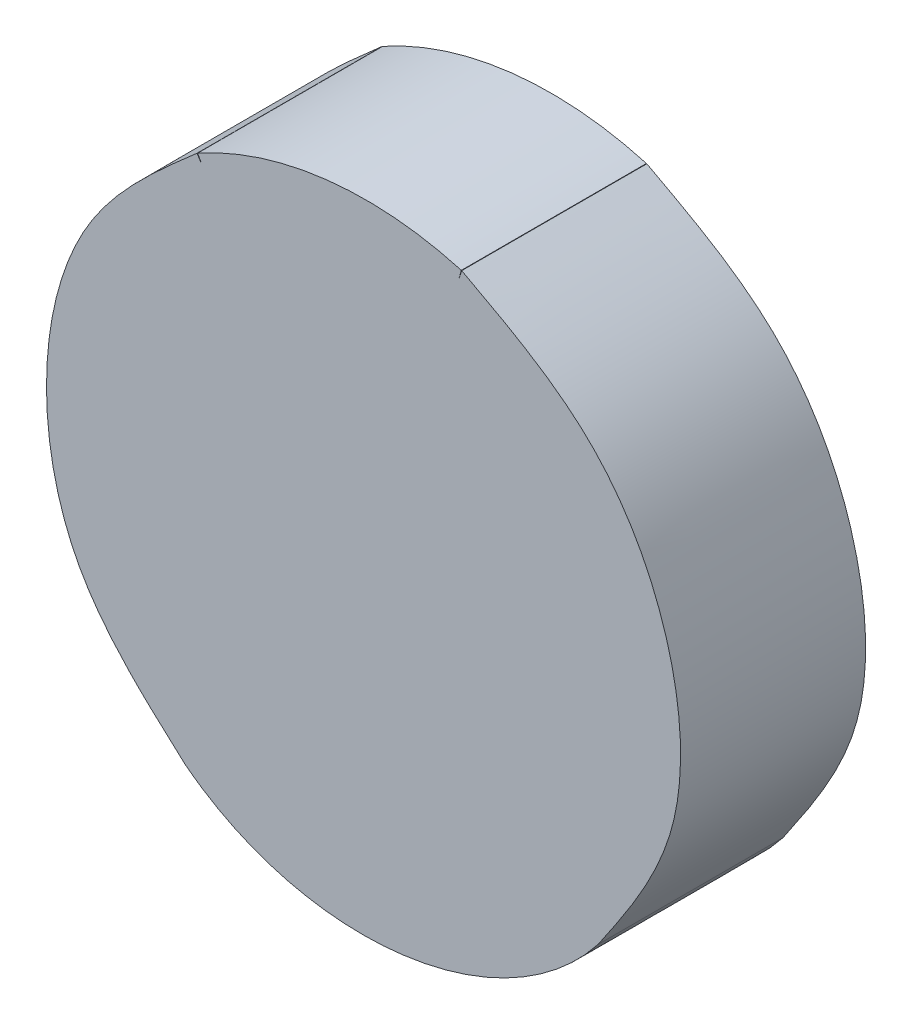
ISO-10303-21;
HEADER;
FILE_DESCRIPTION(('STEP AP214'),'2;1');
FILE_NAME('part.step','',(''),(''),'','','');
FILE_SCHEMA(('AUTOMOTIVE_DESIGN { 1 0 10303 214 1 1 1 1 }'));
ENDSEC;
DATA;
#1=APPLICATION_CONTEXT('core data for automotive mechanical design processes');
#2=APPLICATION_PROTOCOL_DEFINITION('international standard','automotive_design',2000,#1);
#3=PRODUCT_CONTEXT('',#1,'mechanical');
#4=PRODUCT('Part','Part','',(#3));
#5=PRODUCT_RELATED_PRODUCT_CATEGORY('part','',(#4));
#6=PRODUCT_DEFINITION_FORMATION('','',#4);
#7=PRODUCT_DEFINITION_CONTEXT('part definition',#1,'design');
#8=PRODUCT_DEFINITION('design','',#6,#7);
#9=PRODUCT_DEFINITION_SHAPE('','',#8);
#10=(LENGTH_UNIT() NAMED_UNIT(*) SI_UNIT(.MILLI.,.METRE.));
#11=(NAMED_UNIT(*) PLANE_ANGLE_UNIT() SI_UNIT($,.RADIAN.));
#12=(NAMED_UNIT(*) SI_UNIT($,.STERADIAN.) SOLID_ANGLE_UNIT());
#13=UNCERTAINTY_MEASURE_WITH_UNIT(LENGTH_MEASURE(1.E-05),#10,'distance_accuracy_value','');
#14=(GEOMETRIC_REPRESENTATION_CONTEXT(3) GLOBAL_UNCERTAINTY_ASSIGNED_CONTEXT((#13)) GLOBAL_UNIT_ASSIGNED_CONTEXT((#10,
#11,#12)) REPRESENTATION_CONTEXT('',''));
#15=CARTESIAN_POINT('',(0.,0.,0.));
#16=DIRECTION('',(0.,0.,1.));
#17=DIRECTION('',(1.,0.,0.));
#18=AXIS2_PLACEMENT_3D('',#15,#16,#17);
#19=CARTESIAN_POINT('',(-17.9585100029639,25.4594414816316,-51.0219187273409));
#20=DIRECTION('',(0.8322225883832,0.554441668153438,0.));
#21=DIRECTION('',(-0.554441668153438,0.8322225883832,0.));
#22=AXIS2_PLACEMENT_3D('',#19,#20,#21);
#23=PLANE('',#22);
#24=CARTESIAN_POINT('',(-17.9585100029639,25.4594414816316,-52.3040000000001));
#25=DIRECTION('',(0.554441668153438,-0.8322225883832,0.));
#26=VECTOR('',#25,1.);
#27=LINE('',#24,#26);
#28=CARTESIAN_POINT('',(-17.9585100029639,25.4594414816316,-52.3040000000001));
#29=VERTEX_POINT('',#28);
#30=CARTESIAN_POINT('',(-17.9235256596213,25.406929626117,-52.3040000000001));
#31=VERTEX_POINT('',#30);
#32=EDGE_CURVE('E382',#29,#31,#27,.T.);
#33=ORIENTED_EDGE('',*,*,#32,.F.);
#34=CARTESIAN_POINT('',(-17.9585100029639,25.4594414816316,-51.0219187273409));
#35=DIRECTION('',(0.,0.,-1.));
#36=VECTOR('',#35,1.);
#37=LINE('',#34,#36);
#38=CARTESIAN_POINT('',(-17.9585100029639,25.4594414816316,-51.0219187273409));
#39=VERTEX_POINT('',#38);
#40=EDGE_CURVE('E35',#39,#29,#37,.T.);
#41=ORIENTED_EDGE('',*,*,#40,.F.);
#42=CARTESIAN_POINT('',(-17.9585100029639,25.4594414816316,-51.0219187273409));
#43=DIRECTION('',(0.554441668153438,-0.8322225883832,0.));
#44=VECTOR('',#43,1.);
#45=LINE('',#42,#44);
#46=CARTESIAN_POINT('',(-17.9235256596213,25.406929626117,-51.0219187273409));
#47=VERTEX_POINT('',#46);
#48=EDGE_CURVE('E202',#39,#47,#45,.T.);
#49=ORIENTED_EDGE('',*,*,#48,.T.);
#50=CARTESIAN_POINT('',(-17.9235256596214,25.4069296261169,-51.0219187273409));
#51=DIRECTION('',(0.,0.,-1.));
#52=VECTOR('',#51,1.);
#53=LINE('',#50,#52);
#54=EDGE_CURVE('E10',#47,#31,#53,.T.);
#55=ORIENTED_EDGE('',*,*,#54,.T.);
#56=EDGE_LOOP('',(#33,#41,#49,#55));
#57=FACE_BOUND('',#56,.T.);
#58=ADVANCED_FACE('F16',(#57),#23,.T.);
#59=CARTESIAN_POINT('',(-17.9235256596213,25.4069296261169,-51.021918727341));
#60=DIRECTION('',(-0.873926326381101,-0.486058408072563,0.));
#61=DIRECTION('',(0.486058408072563,-0.873926326381101,0.));
#62=AXIS2_PLACEMENT_3D('',#59,#60,#61);
#63=PLANE('',#62);
#64=DIRECTION('',(-0.486058408072563,0.873926326381101,3.2990859998867E-13));
#65=VECTOR('',#64,1.);
#66=CARTESIAN_POINT('',(-17.9235256596213,25.4069296261169,-52.3040000000001));
#67=LINE('',#66,#65);
#68=CARTESIAN_POINT('',(-17.9541951334528,25.4620729178541,-52.3040000000001));
#69=VERTEX_POINT('',#68);
#70=EDGE_CURVE('E384',#31,#69,#67,.T.);
#71=ORIENTED_EDGE('',*,*,#70,.F.);
#72=ORIENTED_EDGE('',*,*,#54,.F.);
#73=DIRECTION('',(-0.486058408072563,0.873926326381101,3.2990859998867E-13));
#74=VECTOR('',#73,1.);
#75=CARTESIAN_POINT('',(-17.9235256596213,25.4069296261169,-51.021918727341));
#76=LINE('',#75,#74);
#77=CARTESIAN_POINT('',(-17.9541951334528,25.4620729178541,-51.0219187273409));
#78=VERTEX_POINT('',#77);
#79=EDGE_CURVE('E253',#47,#78,#76,.T.);
#80=ORIENTED_EDGE('',*,*,#79,.T.);
#81=DIRECTION('',(0.,0.,-1.));
#82=VECTOR('',#81,1.);
#83=CARTESIAN_POINT('',(-17.9541951334528,25.4620729178541,-51.0219187273409));
#84=LINE('',#83,#82);
#85=EDGE_CURVE('E27',#78,#69,#84,.T.);
#86=ORIENTED_EDGE('',*,*,#85,.T.);
#87=EDGE_LOOP('',(#71,#72,#80,#86));
#88=FACE_BOUND('',#87,.T.);
#89=ADVANCED_FACE('F363',(#88),#63,.T.);
#90=CARTESIAN_POINT('',(-16.7861611361917,23.3619638705433,-51.0219187273409));
#91=DIRECTION('',(0.,0.,-1.));
#92=DIRECTION('',(-1.,0.,0.));
#93=AXIS2_PLACEMENT_3D('',#90,#91,#92);
#94=CYLINDRICAL_SURFACE('',#93,2.40307332999939);
#95=CARTESIAN_POINT('',(-16.7861611361917,23.3619638705433,-52.3040000000001));
#96=DIRECTION('',(0.,0.,-1.));
#97=DIRECTION('',(-0.486058408072544,0.873926326381111,0.));
#98=AXIS2_PLACEMENT_3D('',#95,#96,#97);
#99=CIRCLE('',#98,2.40307332999939);
#100=CARTESIAN_POINT('',(-16.1270845088251,25.672889968153,-52.3040000000001));
#101=VERTEX_POINT('',#100);
#102=EDGE_CURVE('E400',#69,#101,#99,.T.);
#103=ORIENTED_EDGE('',*,*,#102,.F.);
#104=ORIENTED_EDGE('',*,*,#85,.F.);
#105=CARTESIAN_POINT('',(-16.7861611361917,23.3619638705433,-51.0219187273409));
#106=DIRECTION('',(0.,0.,-1.));
#107=DIRECTION('',(-0.486058408072544,0.873926326381111,0.));
#108=AXIS2_PLACEMENT_3D('',#105,#106,#107);
#109=CIRCLE('',#108,2.40307332999939);
#110=CARTESIAN_POINT('',(-16.1270845088251,25.672889968153,-51.0219187273409));
#111=VERTEX_POINT('',#110);
#112=EDGE_CURVE('E292',#78,#111,#109,.T.);
#113=ORIENTED_EDGE('',*,*,#112,.T.);
#114=DIRECTION('',(0.,0.,-1.));
#115=VECTOR('',#114,1.);
#116=CARTESIAN_POINT('',(-16.1270845088251,25.672889968153,-51.0219187273409));
#117=LINE('',#116,#115);
#118=EDGE_CURVE('E229',#111,#101,#117,.T.);
#119=ORIENTED_EDGE('',*,*,#118,.T.);
#120=EDGE_LOOP('',(#103,#104,#113,#119));
#121=FACE_BOUND('',#120,.T.);
#122=ADVANCED_FACE('F371',(#121),#94,.T.);
#123=CARTESIAN_POINT('',(-16.1270845088251,25.672889968153,-51.0219187273409));
#124=DIRECTION('',(0.96165442342546,-0.274264051428993,0.));
#125=DIRECTION('',(0.274264051428993,0.961654423425461,0.));
#126=AXIS2_PLACEMENT_3D('',#123,#124,#125);
#127=PLANE('',#126);
#128=DIRECTION('',(-0.274264051428993,-0.96165442342546,-3.29908599988693E-13));
#129=VECTOR('',#128,1.);
#130=CARTESIAN_POINT('',(-16.1270845088251,25.672889968153,-52.3040000000001));
#131=LINE('',#130,#129);
#132=CARTESIAN_POINT('',(-16.1443901124492,25.6122111799983,-52.3040000000001));
#133=VERTEX_POINT('',#132);
#134=EDGE_CURVE('E403',#101,#133,#131,.T.);
#135=ORIENTED_EDGE('',*,*,#134,.F.);
#136=ORIENTED_EDGE('',*,*,#118,.F.);
#137=DIRECTION('',(-0.274264051428993,-0.96165442342546,-3.29908599988693E-13));
#138=VECTOR('',#137,1.);
#139=CARTESIAN_POINT('',(-16.1270845088251,25.672889968153,-51.0219187273409));
#140=LINE('',#139,#138);
#141=CARTESIAN_POINT('',(-16.1443901124492,25.6122111799983,-51.0219187273409));
#142=VERTEX_POINT('',#141);
#143=EDGE_CURVE('E296',#111,#142,#140,.T.);
#144=ORIENTED_EDGE('',*,*,#143,.T.);
#145=CARTESIAN_POINT('',(-16.1443901124492,25.6122111799983,-51.0219187273409));
#146=DIRECTION('',(0.,0.,-1.));
#147=VECTOR('',#146,1.);
#148=LINE('',#145,#147);
#149=EDGE_CURVE('E234',#142,#133,#148,.T.);
#150=ORIENTED_EDGE('',*,*,#149,.T.);
#151=EDGE_LOOP('',(#135,#136,#144,#150));
#152=FACE_BOUND('',#151,.T.);
#153=ADVANCED_FACE('F322',(#152),#127,.T.);
#154=CARTESIAN_POINT('',(-16.1246524741276,25.6721963513265,-51.0219187273409));
#155=DIRECTION('',(-0.949899115814475,0.312556666502056,0.));
#156=DIRECTION('',(-0.312556666502056,-0.949899115814476,0.));
#157=AXIS2_PLACEMENT_3D('',#154,#155,#156);
#158=PLANE('',#157);
#159=CARTESIAN_POINT('',(-16.1443901124492,25.6122111799983,-52.3040000000001));
#160=DIRECTION('',(0.312556666502056,0.949899115814475,0.));
#161=VECTOR('',#160,1.);
#162=LINE('',#159,#161);
#163=CARTESIAN_POINT('',(-16.1246524741276,25.6721963513265,-52.3040000000001));
#164=VERTEX_POINT('',#163);
#165=EDGE_CURVE('E208',#133,#164,#162,.T.);
#166=ORIENTED_EDGE('',*,*,#165,.F.);
#167=ORIENTED_EDGE('',*,*,#149,.F.);
#168=CARTESIAN_POINT('',(-16.1443901124492,25.6122111799983,-51.0219187273409));
#169=DIRECTION('',(0.312556666502056,0.949899115814475,0.));
#170=VECTOR('',#169,1.);
#171=LINE('',#168,#170);
#172=CARTESIAN_POINT('',(-16.1246524741276,25.6721963513265,-51.0219187273409));
#173=VERTEX_POINT('',#172);
#174=EDGE_CURVE('E116',#142,#173,#171,.T.);
#175=ORIENTED_EDGE('',*,*,#174,.T.);
#176=CARTESIAN_POINT('',(-16.1246524741276,25.6721963513265,-52.3040000000001));
#177=DIRECTION('',(0.,0.,1.));
#178=VECTOR('',#177,1.);
#179=LINE('',#176,#178);
#180=EDGE_CURVE('E104',#173,#164,#179,.F.);
#181=ORIENTED_EDGE('',*,*,#180,.T.);
#182=EDGE_LOOP('',(#166,#167,#175,#181));
#183=FACE_BOUND('',#182,.T.);
#184=ADVANCED_FACE('F303',(#183),#158,.T.);
#185=CARTESIAN_POINT('',(-15.1805327508488,22.101617603026,-51.0219187273409));
#186=CARTESIAN_POINT('',(-14.9720709850548,22.4069582808454,-51.0219187273409));
#187=CARTESIAN_POINT('',(-14.5552956871221,23.0174225138644,-51.0219187273409));
#188=CARTESIAN_POINT('',(-14.6153007486994,24.160354337476,-51.0219187273409));
#189=CARTESIAN_POINT('',(-15.1540418997386,25.1551607704051,-51.0219187273409));
#190=CARTESIAN_POINT('',(-15.8010090212197,25.4997943756001,-51.0219187273409));
#191=CARTESIAN_POINT('',(-16.1246524741276,25.6721963513265,-51.0219187273409));
#192=B_SPLINE_CURVE_WITH_KNOTS('',3,(#185,#186,#187,#188,#189,#190,#191),.UNSPECIFIED.,.F.,.F.,
(4,1,1,1,4),(0.,0.250516938772342,0.500855739163443,0.750304510519087,1.),.UNSPECIFIED.);
#193=DIRECTION('',(0.,0.,-1.));
#194=VECTOR('',#193,1.);
#195=SURFACE_OF_LINEAR_EXTRUSION('',#192,#194);
#196=CARTESIAN_POINT('',(-15.1805327508488,22.101617603026,-52.3040000000001));
#197=CARTESIAN_POINT('',(-14.9720709850548,22.4069582808454,-52.3040000000001));
#198=CARTESIAN_POINT('',(-14.5552956871221,23.0174225138644,-52.3040000000001));
#199=CARTESIAN_POINT('',(-14.6153007486994,24.160354337476,-52.3040000000001));
#200=CARTESIAN_POINT('',(-15.1540418997386,25.1551607704051,-52.3040000000001));
#201=CARTESIAN_POINT('',(-15.8010090212197,25.4997943756001,-52.3040000000001));
#202=CARTESIAN_POINT('',(-16.1246524741276,25.6721963513265,-52.3040000000001));
#203=B_SPLINE_CURVE_WITH_KNOTS('',3,(#196,#197,#198,#199,#200,#201,#202),.UNSPECIFIED.,.F.,.F.,
(4,1,1,1,4),(0.,0.250516938772342,0.500855739163443,0.750304510519087,1.),.UNSPECIFIED.);
#204=CARTESIAN_POINT('',(-15.1805345153285,22.101619119651,-52.3040000000001));
#205=VERTEX_POINT('',#204);
#206=EDGE_CURVE('E205',#164,#205,#203,.F.);
#207=ORIENTED_EDGE('',*,*,#206,.F.);
#208=ORIENTED_EDGE('',*,*,#180,.F.);
#209=CARTESIAN_POINT('',(-16.1246524741276,25.6721963513265,-51.0219187273409));
#210=CARTESIAN_POINT('',(-15.8010090212197,25.4997943756001,-51.0219187273409));
#211=CARTESIAN_POINT('',(-15.1540418997386,25.1551607704051,-51.0219187273409));
#212=CARTESIAN_POINT('',(-14.6153007486994,24.160354337476,-51.0219187273409));
#213=CARTESIAN_POINT('',(-14.5552956871221,23.0174225138644,-51.0219187273409));
#214=CARTESIAN_POINT('',(-14.9720709850548,22.4069582808454,-51.0219187273409));
#215=CARTESIAN_POINT('',(-15.1805327508488,22.101617603026,-51.0219187273409));
#216=B_SPLINE_CURVE_WITH_KNOTS('',3,(#209,#210,#211,#212,#213,#214,#215),.UNSPECIFIED.,.F.,.F.,
(4,1,1,1,4),(0.,0.249695489480913,0.499144260836557,0.749483061227658,1.),.UNSPECIFIED.);
#217=CARTESIAN_POINT('',(-15.1805345153285,22.101619119651,-51.0219187273409));
#218=VERTEX_POINT('',#217);
#219=EDGE_CURVE('E108',#173,#218,#216,.T.);
#220=ORIENTED_EDGE('',*,*,#219,.T.);
#221=CARTESIAN_POINT('',(-15.1805327508488,22.101617603026,-51.0219187273409));
#222=DIRECTION('',(0.,0.,-1.));
#223=VECTOR('',#222,1.);
#224=LINE('',#221,#223);
#225=EDGE_CURVE('E91',#218,#205,#224,.T.);
#226=ORIENTED_EDGE('',*,*,#225,.T.);
#227=EDGE_LOOP('',(#207,#208,#220,#226));
#228=FACE_BOUND('',#227,.T.);
#229=ADVANCED_FACE('F110',(#228),#195,.F.);
#230=CARTESIAN_POINT('',(-15.178745488046,22.1039011729961,-51.0219187273409));
#231=CARTESIAN_POINT('',(-15.8430209544582,21.2551622496721,-51.0219187273412));
#232=CARTESIAN_POINT('',(-17.1954366509493,21.0902349851489,-51.0219187273407));
#233=CARTESIAN_POINT('',(-18.0442238337388,21.7545482223974,-51.021918727341));
#234=B_SPLINE_CURVE_WITH_KNOTS('',3,(#230,#231,#232,#233),.UNSPECIFIED.,.F.,.F.,(4,4),(0.,1.),.UNSPECIFIED.);
#235=DIRECTION('',(0.,0.,-1.));
#236=VECTOR('',#235,1.);
#237=SURFACE_OF_LINEAR_EXTRUSION('',#234,#236);
#238=CARTESIAN_POINT('',(-15.178745488046,22.1039011729961,-52.3040000000001));
#239=CARTESIAN_POINT('',(-15.8430209544582,21.2551622496721,-52.3040000000003));
#240=CARTESIAN_POINT('',(-17.1954366509493,21.0902349851489,-52.3039999999999));
#241=CARTESIAN_POINT('',(-18.0442238337388,21.7545482223974,-52.3040000000001));
#242=B_SPLINE_CURVE_WITH_KNOTS('',3,(#238,#239,#240,#241),.UNSPECIFIED.,.F.,.F.,(4,4),(0.,1.),.UNSPECIFIED.);
#243=CARTESIAN_POINT('',(-18.0419402637688,21.7527609595946,-52.3040000000001));
#244=VERTEX_POINT('',#243);
#245=EDGE_CURVE('E99',#205,#244,#242,.T.);
#246=ORIENTED_EDGE('',*,*,#245,.F.);
#247=ORIENTED_EDGE('',*,*,#225,.F.);
#248=CARTESIAN_POINT('',(-18.0419402637688,21.7527609595946,-51.0219187273409));
#249=VERTEX_POINT('',#248);
#250=EDGE_CURVE('E96',#218,#249,#234,.T.);
#251=ORIENTED_EDGE('',*,*,#250,.T.);
#252=CARTESIAN_POINT('',(-18.0419388334339,21.7527627916746,-51.0219187273409));
#253=DIRECTION('',(0.,0.,-1.));
#254=VECTOR('',#253,1.);
#255=LINE('',#252,#254);
#256=EDGE_CURVE('E64',#249,#244,#255,.T.);
#257=ORIENTED_EDGE('',*,*,#256,.T.);
#258=EDGE_LOOP('',(#246,#247,#251,#257));
#259=FACE_BOUND('',#258,.T.);
#260=ADVANCED_FACE('F94',(#259),#237,.T.);
#261=CARTESIAN_POINT('',(-17.9585100029639,25.4594414816316,-51.0219187273409));
#262=CARTESIAN_POINT('',(-18.2364907119851,25.2164460045791,-51.0219187273409));
#263=CARTESIAN_POINT('',(-18.7923626648342,24.7305332560349,-51.0219187273409));
#264=CARTESIAN_POINT('',(-19.0835994922088,23.6287914207275,-51.0219187273409));
#265=CARTESIAN_POINT('',(-18.8707869196629,22.4977560112366,-51.0219187273409));
#266=CARTESIAN_POINT('',(-18.3182221688628,22.0010923616575,-51.0219187273409));
#267=CARTESIAN_POINT('',(-18.0419402637688,21.7527609595946,-51.0219187273409));
#268=B_SPLINE_CURVE_WITH_KNOTS('',3,(#261,#262,#263,#264,#265,#266,#267),.UNSPECIFIED.,.F.,.F.,
(4,1,1,1,4),(0.,0.249800805132472,0.499521214480128,0.749761033213948,1.),.UNSPECIFIED.);
#269=DIRECTION('',(0.,0.,-1.));
#270=VECTOR('',#269,1.);
#271=SURFACE_OF_LINEAR_EXTRUSION('',#268,#270);
#272=CARTESIAN_POINT('',(-17.9585100029639,25.4594414816316,-52.3040000000001));
#273=CARTESIAN_POINT('',(-18.2364907119851,25.2164460045791,-52.3040000000001));
#274=CARTESIAN_POINT('',(-18.7923626648342,24.7305332560349,-52.3040000000001));
#275=CARTESIAN_POINT('',(-19.0835994922088,23.6287914207275,-52.3040000000001));
#276=CARTESIAN_POINT('',(-18.8707869196629,22.4977560112366,-52.3040000000001));
#277=CARTESIAN_POINT('',(-18.3182221688628,22.0010923616575,-52.3040000000001));
#278=CARTESIAN_POINT('',(-18.0419402637688,21.7527609595946,-52.3040000000001));
#279=B_SPLINE_CURVE_WITH_KNOTS('',3,(#272,#273,#274,#275,#276,#277,#278),.UNSPECIFIED.,.F.,.F.,
(4,1,1,1,4),(0.,0.249800805132472,0.499521214480128,0.749761033213948,1.),.UNSPECIFIED.);
#280=EDGE_CURVE('E176',#244,#29,#279,.F.);
#281=ORIENTED_EDGE('',*,*,#280,.F.);
#282=ORIENTED_EDGE('',*,*,#256,.F.);
#283=CARTESIAN_POINT('',(-18.0419402637688,21.7527609595946,-51.0219187273409));
#284=CARTESIAN_POINT('',(-18.3182221688628,22.0010923616575,-51.0219187273409));
#285=CARTESIAN_POINT('',(-18.8707869196629,22.4977560112366,-51.0219187273409));
#286=CARTESIAN_POINT('',(-19.0835994922088,23.6287914207275,-51.0219187273409));
#287=CARTESIAN_POINT('',(-18.7923626648342,24.7305332560349,-51.0219187273409));
#288=CARTESIAN_POINT('',(-18.2364907119851,25.2164460045791,-51.0219187273409));
#289=CARTESIAN_POINT('',(-17.9585100029639,25.4594414816316,-51.0219187273409));
#290=B_SPLINE_CURVE_WITH_KNOTS('',3,(#283,#284,#285,#286,#287,#288,#289),.UNSPECIFIED.,.F.,.F.,
(4,1,1,1,4),(0.,0.250238966786052,0.500478785519872,0.750199194867528,1.),.UNSPECIFIED.);
#291=EDGE_CURVE('E121',#249,#39,#290,.T.);
#292=ORIENTED_EDGE('',*,*,#291,.T.);
#293=ORIENTED_EDGE('',*,*,#40,.T.);
#294=EDGE_LOOP('',(#281,#282,#292,#293));
#295=FACE_BOUND('',#294,.T.);
#296=ADVANCED_FACE('F143',(#295),#271,.F.);
#297=CARTESIAN_POINT('',(-18.0201067097001,21.815912892897,-51.0219187273409));
#298=DIRECTION('',(0.,0.,-1.));
#299=DIRECTION('',(0.,1.,0.));
#300=AXIS2_PLACEMENT_3D('',#297,#298,#299);
#301=PLANE('',#300);
#302=ORIENTED_EDGE('',*,*,#48,.F.);
#303=ORIENTED_EDGE('',*,*,#291,.F.);
#304=ORIENTED_EDGE('',*,*,#250,.F.);
#305=ORIENTED_EDGE('',*,*,#219,.F.);
#306=ORIENTED_EDGE('',*,*,#174,.F.);
#307=ORIENTED_EDGE('',*,*,#143,.F.);
#308=ORIENTED_EDGE('',*,*,#112,.F.);
#309=ORIENTED_EDGE('',*,*,#79,.F.);
#310=EDGE_LOOP('',(#302,#303,#304,#305,#306,#307,#308,#309));
#311=FACE_BOUND('',#310,.T.);
#312=ADVANCED_FACE('F120',(#311),#301,.F.);
#313=CARTESIAN_POINT('',(-18.0201067097001,21.815912892897,-52.3040000000001));
#314=DIRECTION('',(0.,0.,-1.));
#315=DIRECTION('',(0.,1.,0.));
#316=AXIS2_PLACEMENT_3D('',#313,#314,#315);
#317=PLANE('',#316);
#318=ORIENTED_EDGE('',*,*,#32,.T.);
#319=ORIENTED_EDGE('',*,*,#70,.T.);
#320=ORIENTED_EDGE('',*,*,#102,.T.);
#321=ORIENTED_EDGE('',*,*,#134,.T.);
#322=ORIENTED_EDGE('',*,*,#165,.T.);
#323=ORIENTED_EDGE('',*,*,#206,.T.);
#324=ORIENTED_EDGE('',*,*,#245,.T.);
#325=ORIENTED_EDGE('',*,*,#280,.T.);
#326=EDGE_LOOP('',(#318,#319,#320,#321,#322,#323,#324,#325));
#327=FACE_BOUND('',#326,.T.);
#328=ADVANCED_FACE('F203',(#327),#317,.T.);
#329=CLOSED_SHELL('',(#58,#89,#122,#153,#184,#229,#260,#296,#312,#328));
#330=MANIFOLD_SOLID_BREP('B1',#329);
#331=ADVANCED_BREP_SHAPE_REPRESENTATION('',(#18,#330),#14);
#332=SHAPE_DEFINITION_REPRESENTATION(#9,#331);
ENDSEC;
END-ISO-10303-21;
